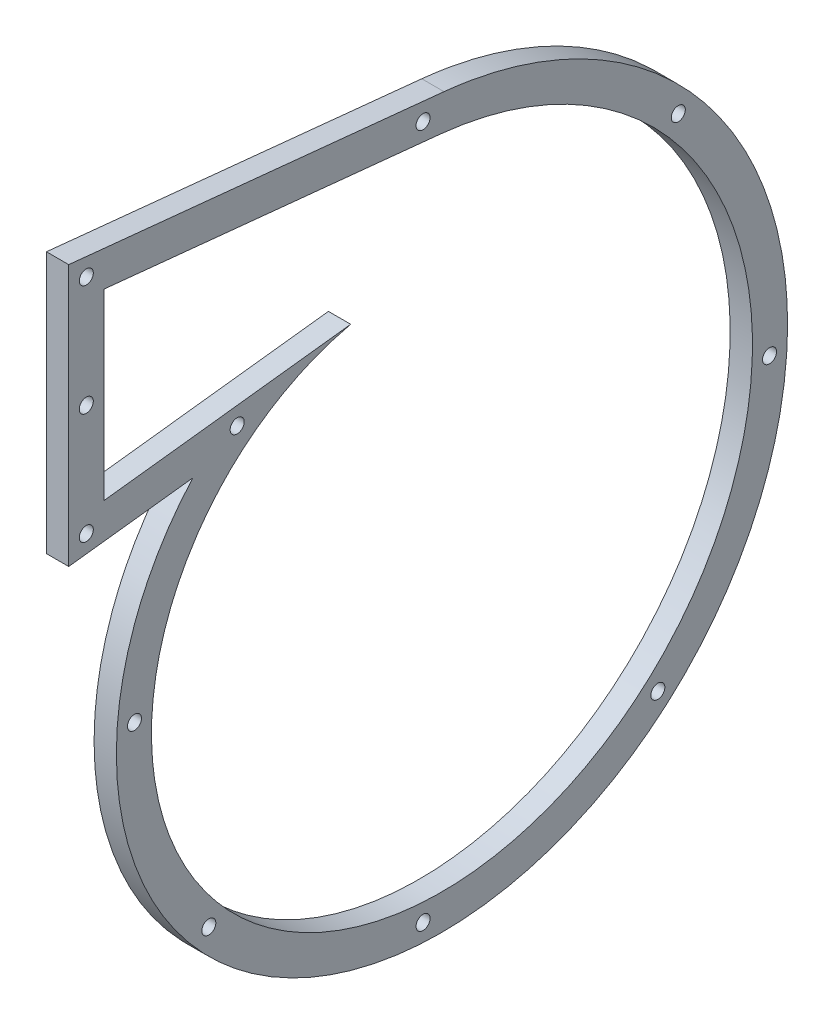
ISO-10303-21;
HEADER;
FILE_DESCRIPTION(('STEP AP214'),'2;1');
FILE_NAME('part.step','',(''),(''),'','','');
FILE_SCHEMA(('AUTOMOTIVE_DESIGN { 1 0 10303 214 1 1 1 1 }'));
ENDSEC;
DATA;
#1=APPLICATION_CONTEXT('core data for automotive mechanical design processes');
#2=APPLICATION_PROTOCOL_DEFINITION('international standard','automotive_design',2000,#1);
#3=PRODUCT_CONTEXT('',#1,'mechanical');
#4=PRODUCT('Part','Part','',(#3));
#5=PRODUCT_RELATED_PRODUCT_CATEGORY('part','',(#4));
#6=PRODUCT_DEFINITION_FORMATION('','',#4);
#7=PRODUCT_DEFINITION_CONTEXT('part definition',#1,'design');
#8=PRODUCT_DEFINITION('design','',#6,#7);
#9=PRODUCT_DEFINITION_SHAPE('','',#8);
#10=(LENGTH_UNIT() NAMED_UNIT(*) SI_UNIT(.MILLI.,.METRE.));
#11=(NAMED_UNIT(*) PLANE_ANGLE_UNIT() SI_UNIT($,.RADIAN.));
#12=(NAMED_UNIT(*) SI_UNIT($,.STERADIAN.) SOLID_ANGLE_UNIT());
#13=UNCERTAINTY_MEASURE_WITH_UNIT(LENGTH_MEASURE(1.E-05),#10,'distance_accuracy_value','');
#14=(GEOMETRIC_REPRESENTATION_CONTEXT(3) GLOBAL_UNCERTAINTY_ASSIGNED_CONTEXT((#13)) GLOBAL_UNIT_ASSIGNED_CONTEXT((#10,
#11,#12)) REPRESENTATION_CONTEXT('',''));
#15=CARTESIAN_POINT('',(0.,0.,0.));
#16=DIRECTION('',(0.,0.,1.));
#17=DIRECTION('',(1.,0.,0.));
#18=AXIS2_PLACEMENT_3D('',#15,#16,#17);
#19=CARTESIAN_POINT('',(6.35,-89.0418354304239,-40.1694675088037));
#20=DIRECTION('',(1.,0.,0.));
#21=DIRECTION('',(0.,0.,-1.));
#22=AXIS2_PLACEMENT_3D('',#19,#20,#21);
#23=PLANE('',#22);
#24=CARTESIAN_POINT('',(6.35,72.7051669902107,-72.7051669902105));
#25=DIRECTION('',(1.,0.,0.));
#26=DIRECTION('',(0.,0.,-1.));
#27=AXIS2_PLACEMENT_3D('',#24,#25,#26);
#28=CIRCLE('',#27,1.99999999999998);
#29=CARTESIAN_POINT('',(6.35,72.7051669902107,-74.7051669902105));
#30=VERTEX_POINT('',#29);
#31=EDGE_CURVE('E228',#30,#30,#28,.T.);
#32=ORIENTED_EDGE('',*,*,#31,.F.);
#33=EDGE_LOOP('',(#32));
#34=FACE_BOUND('',#33,.T.);
#35=CARTESIAN_POINT('',(6.35,-66.8740788460314,-66.8740788460321));
#36=DIRECTION('',(1.,0.,0.));
#37=DIRECTION('',(0.,0.,-1.));
#38=AXIS2_PLACEMENT_3D('',#35,#36,#37);
#39=CIRCLE('',#38,2.00000000000001);
#40=CARTESIAN_POINT('',(6.35,-66.8740788460314,-68.8740788460322));
#41=VERTEX_POINT('',#40);
#42=EDGE_CURVE('E218',#41,#41,#39,.T.);
#43=ORIENTED_EDGE('',*,*,#42,.F.);
#44=EDGE_LOOP('',(#43));
#45=FACE_BOUND('',#44,.T.);
#46=CARTESIAN_POINT('',(6.35,-61.0399944903384,61.0399944903381));
#47=DIRECTION('',(1.,0.,0.));
#48=DIRECTION('',(0.,0.,-1.));
#49=AXIS2_PLACEMENT_3D('',#46,#47,#48);
#50=CIRCLE('',#49,1.99999999999974);
#51=CARTESIAN_POINT('',(6.35,-61.0399944903384,59.0399944903384));
#52=VERTEX_POINT('',#51);
#53=EDGE_CURVE('E215',#52,#52,#50,.T.);
#54=ORIENTED_EDGE('',*,*,#53,.F.);
#55=EDGE_LOOP('',(#54));
#56=FACE_BOUND('',#55,.T.);
#57=CARTESIAN_POINT('',(6.35,107.089716810776,0.));
#58=DIRECTION('',(1.,0.,0.));
#59=DIRECTION('',(0.,0.,-1.));
#60=AXIS2_PLACEMENT_3D('',#57,#58,#59);
#61=CIRCLE('',#60,2.);
#62=CARTESIAN_POINT('',(6.35,107.089716810776,-2.));
#63=VERTEX_POINT('',#62);
#64=EDGE_CURVE('E212',#63,#63,#61,.T.);
#65=ORIENTED_EDGE('',*,*,#64,.F.);
#66=EDGE_LOOP('',(#65));
#67=FACE_BOUND('',#66,.T.);
#68=CARTESIAN_POINT('',(6.35,0.,-98.6958822274498));
#69=DIRECTION('',(1.,0.,0.));
#70=DIRECTION('',(0.,0.,-1.));
#71=AXIS2_PLACEMENT_3D('',#68,#69,#70);
#72=CIRCLE('',#71,2.);
#73=CARTESIAN_POINT('',(6.35,0.,-100.69588222745));
#74=VERTEX_POINT('',#73);
#75=EDGE_CURVE('E208',#74,#74,#72,.T.);
#76=ORIENTED_EDGE('',*,*,#75,.F.);
#77=EDGE_LOOP('',(#76));
#78=FACE_BOUND('',#77,.T.);
#79=CARTESIAN_POINT('',(6.35,-4.99262632104591E-11,82.2024791798422));
#80=DIRECTION('',(1.,0.,0.));
#81=DIRECTION('',(0.,0.,-1.));
#82=AXIS2_PLACEMENT_3D('',#79,#80,#81);
#83=CIRCLE('',#82,2.);
#84=CARTESIAN_POINT('',(6.35,-4.99262632104591E-11,80.2024791798422));
#85=VERTEX_POINT('',#84);
#86=EDGE_CURVE('E204',#85,#85,#83,.T.);
#87=ORIENTED_EDGE('',*,*,#86,.F.);
#88=EDGE_LOOP('',(#87));
#89=FACE_BOUND('',#88,.T.);
#90=CARTESIAN_POINT('',(6.35,-90.4489628653455,0.));
#91=DIRECTION('',(1.,0.,0.));
#92=DIRECTION('',(0.,0.,-1.));
#93=AXIS2_PLACEMENT_3D('',#90,#91,#92);
#94=CIRCLE('',#93,2.);
#95=CARTESIAN_POINT('',(6.35,-90.4489628653455,-2.));
#96=VERTEX_POINT('',#95);
#97=EDGE_CURVE('E200',#96,#96,#94,.T.);
#98=ORIENTED_EDGE('',*,*,#97,.F.);
#99=EDGE_LOOP('',(#98));
#100=FACE_BOUND('',#99,.T.);
#101=CARTESIAN_POINT('',(6.35,58.5427770399441,52.9561202609433));
#102=DIRECTION('',(1.,0.,0.));
#103=DIRECTION('',(0.,0.,-1.));
#104=AXIS2_PLACEMENT_3D('',#101,#102,#103);
#105=CIRCLE('',#104,2.);
#106=CARTESIAN_POINT('',(6.35,58.5427770399441,50.9561202609433));
#107=VERTEX_POINT('',#106);
#108=EDGE_CURVE('E196',#107,#107,#105,.T.);
#109=ORIENTED_EDGE('',*,*,#108,.F.);
#110=EDGE_LOOP('',(#109));
#111=FACE_BOUND('',#110,.T.);
#112=CARTESIAN_POINT('',(6.35,85.0996668726546,95.9356798243954));
#113=DIRECTION('',(1.,0.,0.));
#114=DIRECTION('',(0.,0.,-1.));
#115=AXIS2_PLACEMENT_3D('',#112,#113,#114);
#116=CIRCLE('',#115,2.);
#117=CARTESIAN_POINT('',(6.35,85.0996668726546,93.9356798243954));
#118=VERTEX_POINT('',#117);
#119=EDGE_CURVE('E192',#118,#118,#116,.T.);
#120=ORIENTED_EDGE('',*,*,#119,.F.);
#121=EDGE_LOOP('',(#120));
#122=FACE_BOUND('',#121,.T.);
#123=CARTESIAN_POINT('',(6.35,53.4379914212541,95.9356798243954));
#124=DIRECTION('',(1.,0.,0.));
#125=DIRECTION('',(0.,0.,-1.));
#126=AXIS2_PLACEMENT_3D('',#123,#124,#125);
#127=CIRCLE('',#126,2.);
#128=CARTESIAN_POINT('',(6.35,53.4379914212541,93.9356798243954));
#129=VERTEX_POINT('',#128);
#130=EDGE_CURVE('E188',#129,#129,#127,.T.);
#131=ORIENTED_EDGE('',*,*,#130,.F.);
#132=EDGE_LOOP('',(#131));
#133=FACE_BOUND('',#132,.T.);
#134=CARTESIAN_POINT('',(6.35,116.761342324055,95.9356798243954));
#135=DIRECTION('',(1.,0.,0.));
#136=DIRECTION('',(0.,0.,-1.));
#137=AXIS2_PLACEMENT_3D('',#134,#135,#136);
#138=CIRCLE('',#137,2.);
#139=CARTESIAN_POINT('',(6.35,116.761342324055,93.9356798243954));
#140=VERTEX_POINT('',#139);
#141=EDGE_CURVE('E184',#140,#140,#138,.T.);
#142=ORIENTED_EDGE('',*,*,#141,.F.);
#143=EDGE_LOOP('',(#142));
#144=FACE_BOUND('',#143,.T.);
#145=CARTESIAN_POINT('',(6.35,52.0095312213766,65.5693373401911));
#146=CARTESIAN_POINT('',(6.35,48.5350696343101,68.6986331983437));
#147=CARTESIAN_POINT('',(6.35,41.0756301305954,74.3664321283951));
#148=CARTESIAN_POINT('',(6.35,24.2520637058495,83.1915350243593));
#149=CARTESIAN_POINT('',(6.35,0.571051966812384,88.8162616805835));
#150=CARTESIAN_POINT('',(6.35,-29.0852806445251,85.8046077579747));
#151=CARTESIAN_POINT('',(6.35,-56.6412137555133,72.9797767825643));
#152=CARTESIAN_POINT('',(6.35,-78.8870477416463,51.4145860868804));
#153=CARTESIAN_POINT('',(6.35,-93.091773694092,23.2206106920859));
#154=CARTESIAN_POINT('',(6.35,-97.3413513977909,-8.65488145362865));
#155=CARTESIAN_POINT('',(6.35,-90.784845908172,-40.7390366050227));
#156=CARTESIAN_POINT('',(6.35,-73.7702775520645,-69.4057771791028));
#157=CARTESIAN_POINT('',(6.35,-47.8483099460183,-91.2895524381608));
#158=CARTESIAN_POINT('',(6.35,-15.6364846974259,-103.677945005173));
#159=CARTESIAN_POINT('',(6.35,19.443777188287,-104.843460982403));
#160=CARTESIAN_POINT('',(6.35,53.5337741097882,-94.2744492893508));
#161=CARTESIAN_POINT('',(6.35,77.8773899523179,-76.3494474098506));
#162=CARTESIAN_POINT('',(6.35,93.2003357726446,-57.5832170108413));
#163=CARTESIAN_POINT('',(6.35,102.269141776905,-41.6726008891398));
#164=CARTESIAN_POINT('',(6.35,107.56058488832,-27.2244570687319));
#165=CARTESIAN_POINT('',(6.35,110.322198964791,-15.1957545265602));
#166=CARTESIAN_POINT('',(6.35,111.202679979657,-9.05017451284664));
#167=CARTESIAN_POINT('',(6.35,111.5131692237,-5.97034096630008));
#168=B_SPLINE_CURVE_WITH_KNOTS('',3,(#145,#146,#147,#148,#149,#150,#151,#152,#153,#154,#155,
#156,#157,#158,#159,#160,#161,#162,#163,#164,#165,#166,#167),.UNSPECIFIED.,.F.,.F.,(4,1,1,1,1,1,
1,1,1,1,1,1,1,1,1,1,1,1,1,1,4),(0.103071112424463,0.131100140161198,0.159129167897934,
0.215187223371405,0.271245278844876,0.327303334318347,0.383361389791818,0.439419445265289,
0.49547750073876,0.551535556212231,0.607593611685702,0.663651667159173,0.719709722632645,
0.775767778106116,0.831825833579587,0.887883889053058,0.915912916789793,0.943941944526529,
0.971970972263264,0.985985486131632,1.),.UNSPECIFIED.);
#169=CARTESIAN_POINT('',(6.35,52.0095312213766,65.5693373401911));
#170=VERTEX_POINT('',#169);
#171=CARTESIAN_POINT('',(6.35,111.5131692237,-5.97034096630008));
#172=VERTEX_POINT('',#171);
#173=EDGE_CURVE('E146',#170,#172,#168,.T.);
#174=ORIENTED_EDGE('',*,*,#173,.T.);
#175=DIRECTION('',(0.,0.100305212463325,0.994956714813608));
#176=VECTOR('',#175,1.);
#177=CARTESIAN_POINT('',(6.35,122.290754790352,100.935679824395));
#178=LINE('',#177,#176);
#179=CARTESIAN_POINT('',(6.35,122.290754790352,100.935679824395));
#180=VERTEX_POINT('',#179);
#181=EDGE_CURVE('E152',#172,#180,#178,.T.);
#182=ORIENTED_EDGE('',*,*,#181,.T.);
#183=DIRECTION('',(0.,-1.,0.));
#184=VECTOR('',#183,1.);
#185=CARTESIAN_POINT('',(6.35,47.8089856985101,100.935679824395));
#186=LINE('',#185,#184);
#187=CARTESIAN_POINT('',(6.35,47.8089856985101,100.935679824395));
#188=VERTEX_POINT('',#187);
#189=EDGE_CURVE('E158',#180,#188,#186,.T.);
#190=ORIENTED_EDGE('',*,*,#189,.T.);
#191=DIRECTION('',(0.,0.11794341053639,-0.993020317974937));
#192=VECTOR('',#191,1.);
#193=CARTESIAN_POINT('',(6.35,52.0095312213766,65.5693373401911));
#194=LINE('',#193,#192);
#195=EDGE_CURVE('E160',#188,#170,#194,.T.);
#196=ORIENTED_EDGE('',*,*,#195,.T.);
#197=EDGE_LOOP('',(#174,#182,#190,#196));
#198=FACE_BOUND('',#197,.T.);
#199=DIRECTION('',(0.,0.100305212463325,0.994956714813608));
#200=VECTOR('',#199,1.);
#201=CARTESIAN_POINT('',(6.35,111.231929857758,90.9356798243954));
#202=LINE('',#201,#200);
#203=CARTESIAN_POINT('',(6.35,101.563602075564,-4.96728884166681));
#204=VERTEX_POINT('',#203);
#205=CARTESIAN_POINT('',(6.35,111.231929857758,90.9356798243954));
#206=VERTEX_POINT('',#205);
#207=EDGE_CURVE('E109',#204,#206,#202,.T.);
#208=ORIENTED_EDGE('',*,*,#207,.F.);
#209=CARTESIAN_POINT('',(6.35,67.4194852953939,20.6122051829531));
#210=CARTESIAN_POINT('',(6.35,66.4552678560406,24.8770825732552));
#211=CARTESIAN_POINT('',(6.35,65.0853522172044,29.0812243731984));
#212=CARTESIAN_POINT('',(6.35,61.5604781519011,37.2155939497697));
#213=CARTESIAN_POINT('',(6.35,59.4055438748039,41.1456375361944));
#214=CARTESIAN_POINT('',(6.35,54.3658335171064,48.5847381169988));
#215=CARTESIAN_POINT('',(6.35,51.4811166245284,52.0936166711833));
#216=CARTESIAN_POINT('',(6.35,45.0646597658859,58.5545172391194));
#217=CARTESIAN_POINT('',(6.35,41.5330126833936,61.5063732318608));
#218=CARTESIAN_POINT('',(6.35,33.930844330253,66.7337542582755));
#219=CARTESIAN_POINT('',(6.35,29.8604470267955,69.0091320507026));
#220=CARTESIAN_POINT('',(6.35,21.3109930600804,72.7852012639892));
#221=CARTESIAN_POINT('',(6.35,16.8320876367388,74.2857700342943));
#222=CARTESIAN_POINT('',(6.35,7.61375402946965,76.4390553325685));
#223=CARTESIAN_POINT('',(6.35,2.87449946388243,77.091678836504));
#224=CARTESIAN_POINT('',(6.35,-6.70336711569687,77.5043513011464));
#225=CARTESIAN_POINT('',(6.35,-11.5417889528338,77.26434092386));
#226=CARTESIAN_POINT('',(6.35,-21.1492766229492,75.8777672233438));
#227=CARTESIAN_POINT('',(6.35,-25.9181422710987,74.731181162277));
#228=CARTESIAN_POINT('',(6.35,-35.2161377026869,71.54946298461));
#229=CARTESIAN_POINT('',(6.35,-39.7450643488679,69.514346368891));
#230=CARTESIAN_POINT('',(6.35,-48.3972133974404,64.6056729667148));
#231=CARTESIAN_POINT('',(6.35,-52.5202370221882,61.7321701971579));
#232=CARTESIAN_POINT('',(6.35,-60.205080669813,55.2278863449585));
#233=CARTESIAN_POINT('',(6.35,-63.7667135805631,51.5971966739674));
#234=CARTESIAN_POINT('',(6.35,-70.1895623436975,43.6885696663724));
#235=CARTESIAN_POINT('',(6.35,-73.0506097818801,39.410758629658));
#236=CARTESIAN_POINT('',(6.35,-77.9547201429567,30.343511501828));
#237=CARTESIAN_POINT('',(6.35,-79.9976398461637,25.5542327714463));
#238=CARTESIAN_POINT('',(6.35,-83.1742726405672,15.6209936722327));
#239=CARTESIAN_POINT('',(6.35,-84.3078734197897,10.4772166906422));
#240=CARTESIAN_POINT('',(6.35,-85.6048461535318,0.00811323748628872));
#241=CARTESIAN_POINT('',(6.35,-85.7681414101208,-5.31700990141025));
#242=CARTESIAN_POINT('',(6.35,-85.096533314692,-15.9653103711518));
#243=CARTESIAN_POINT('',(6.35,-84.2615923874771,-21.2882713503272));
#244=CARTESIAN_POINT('',(6.35,-81.6003211965658,-31.7447122070156));
#245=CARTESIAN_POINT('',(6.35,-79.7739946409418,-36.8779702497012));
#246=CARTESIAN_POINT('',(6.35,-75.1720556442354,-46.7700327795938));
#247=CARTESIAN_POINT('',(6.35,-72.3964889028165,-51.5286178316446));
#248=CARTESIAN_POINT('',(6.35,-65.9727273891574,-60.4955749517899));
#249=CARTESIAN_POINT('',(6.35,-62.3246195112766,-64.7037379344225));
#250=CARTESIAN_POINT('',(6.35,-54.2649944811481,-72.4097634454924));
#251=CARTESIAN_POINT('',(6.35,-49.8536031166979,-75.9074349681451));
#252=CARTESIAN_POINT('',(6.35,-40.4059900718697,-82.0540933980427));
#253=CARTESIAN_POINT('',(6.35,-35.3699293227021,-84.7029146048004));
#254=CARTESIAN_POINT('',(6.35,-24.8365998111231,-89.0405698774917));
#255=CARTESIAN_POINT('',(6.35,-19.3395220337717,-90.7292699984907));
#256=CARTESIAN_POINT('',(6.35,-8.06752417025413,-93.0669813290644));
#257=CARTESIAN_POINT('',(6.35,-2.29281885367992,-93.7158957765585));
#258=CARTESIAN_POINT('',(6.35,9.3374369523603,-93.9294155480087));
#259=CARTESIAN_POINT('',(6.35,15.1927561314082,-93.4939654823078));
#260=CARTESIAN_POINT('',(6.35,26.7803315506483,-91.53151500214));
#261=CARTESIAN_POINT('',(6.35,32.5123479134542,-90.0045033486595));
#262=CARTESIAN_POINT('',(6.35,43.6495982980174,-85.8900763529946));
#263=CARTESIAN_POINT('',(6.35,49.0545923045555,-83.3026951638372));
#264=CARTESIAN_POINT('',(6.35,59.3414990502673,-77.136723273371));
#265=CARTESIAN_POINT('',(6.35,64.2231802247645,-73.5582117497144));
#266=CARTESIAN_POINT('',(6.35,73.281690263301,-65.5155179087759));
#267=CARTESIAN_POINT('',(6.35,77.4583044540138,-61.0514578025197));
#268=CARTESIAN_POINT('',(6.35,84.9461637665878,-51.3765198538172));
#269=CARTESIAN_POINT('',(6.35,88.2572190930759,-46.1658036840856));
#270=CARTESIAN_POINT('',(6.35,93.8807959902057,-35.1654472440658));
#271=CARTESIAN_POINT('',(6.35,96.1931598804697,-29.3760030572643));
#272=CARTESIAN_POINT('',(6.35,99.7187809639932,-17.4097372696192));
#273=CARTESIAN_POINT('',(6.35,100.931918806139,-11.2331397891412));
#274=CARTESIAN_POINT('',(6.35,101.563602075564,-4.96728884166681));
#275=B_SPLINE_CURVE_WITH_KNOTS('',3,(#209,#210,#211,#212,#213,#214,#215,#216,#217,#218,#219,
#220,#221,#222,#223,#224,#225,#226,#227,#228,#229,#230,#231,#232,#233,#234,#235,#236,#237,#238,
#239,#240,#241,#242,#243,#244,#245,#246,#247,#248,#249,#250,#251,#252,#253,#254,#255,#256,#257,
#258,#259,#260,#261,#262,#263,#264,#265,#266,#267,#268,#269,#270,#271,#272,#273,#274),
.UNSPECIFIED.,.F.,.F.,(4,2,2,2,2,2,2,2,2,2,2,2,2,2,2,2,2,2,2,2,2,2,2,2,2,2,2,2,2,2,2,2,4),(0.,
0.03125,0.0625,0.09375,0.125,0.15625,0.1875,0.21875,0.25,0.28125,0.3125,0.34375,0.375,0.40625,
0.4375,0.46875,0.5,0.53125,0.5625,0.59375,0.625,0.65625,0.6875,0.71875,0.75,0.78125,0.8125,
0.84375,0.875,0.90625,0.9375,0.96875,1.),.UNSPECIFIED.);
#276=CARTESIAN_POINT('',(6.35,67.4194852953939,20.6122051829531));
#277=VERTEX_POINT('',#276);
#278=EDGE_CURVE('E101',#277,#204,#275,.T.);
#279=ORIENTED_EDGE('',*,*,#278,.F.);
#280=DIRECTION('',(0.,0.11794341053639,-0.993020317974937));
#281=VECTOR('',#280,1.);
#282=CARTESIAN_POINT('',(6.35,67.4194852953939,20.6122051829531));
#283=LINE('',#282,#281);
#284=CARTESIAN_POINT('',(6.35,59.0669971439981,90.9356798243954));
#285=VERTEX_POINT('',#284);
#286=EDGE_CURVE('E123',#285,#277,#283,.T.);
#287=ORIENTED_EDGE('',*,*,#286,.F.);
#288=DIRECTION('',(0.,-1.,0.));
#289=VECTOR('',#288,1.);
#290=CARTESIAN_POINT('',(6.35,59.066997143998,90.9356798243954));
#291=LINE('',#290,#289);
#292=EDGE_CURVE('E121',#206,#285,#291,.T.);
#293=ORIENTED_EDGE('',*,*,#292,.F.);
#294=EDGE_LOOP('',(#208,#279,#287,#293));
#295=FACE_BOUND('',#294,.T.);
#296=ADVANCED_FACE('F33',(#34,#45,#56,#67,#78,#89,#100,#111,#122,#133,#144,#198,#295),#23,.T.);
#297=CARTESIAN_POINT('',(0.,-89.0418354304239,-40.1694675088037));
#298=DIRECTION('',(1.,0.,0.));
#299=DIRECTION('',(0.,0.,-1.));
#300=AXIS2_PLACEMENT_3D('',#297,#298,#299);
#301=PLANE('',#300);
#302=CARTESIAN_POINT('',(0.,72.7051669902107,-72.7051669902105));
#303=DIRECTION('',(1.,0.,0.));
#304=DIRECTION('',(0.,0.,-1.));
#305=AXIS2_PLACEMENT_3D('',#302,#303,#304);
#306=CIRCLE('',#305,1.99999999999998);
#307=CARTESIAN_POINT('',(0.,72.7051669902107,-74.7051669902105));
#308=VERTEX_POINT('',#307);
#309=EDGE_CURVE('E38',#308,#308,#306,.T.);
#310=ORIENTED_EDGE('',*,*,#309,.T.);
#311=EDGE_LOOP('',(#310));
#312=FACE_BOUND('',#311,.T.);
#313=CARTESIAN_POINT('',(0.,-66.8740788460314,-66.8740788460321));
#314=DIRECTION('',(1.,0.,0.));
#315=DIRECTION('',(0.,0.,-1.));
#316=AXIS2_PLACEMENT_3D('',#313,#314,#315);
#317=CIRCLE('',#316,2.00000000000001);
#318=CARTESIAN_POINT('',(0.,-66.8740788460314,-68.8740788460322));
#319=VERTEX_POINT('',#318);
#320=EDGE_CURVE('E216',#319,#319,#317,.T.);
#321=ORIENTED_EDGE('',*,*,#320,.T.);
#322=EDGE_LOOP('',(#321));
#323=FACE_BOUND('',#322,.T.);
#324=CARTESIAN_POINT('',(0.,-61.0399944903384,61.0399944903381));
#325=DIRECTION('',(1.,0.,0.));
#326=DIRECTION('',(0.,0.,-1.));
#327=AXIS2_PLACEMENT_3D('',#324,#325,#326);
#328=CIRCLE('',#327,1.99999999999974);
#329=CARTESIAN_POINT('',(0.,-61.0399944903384,59.0399944903384));
#330=VERTEX_POINT('',#329);
#331=EDGE_CURVE('E213',#330,#330,#328,.T.);
#332=ORIENTED_EDGE('',*,*,#331,.T.);
#333=EDGE_LOOP('',(#332));
#334=FACE_BOUND('',#333,.T.);
#335=CARTESIAN_POINT('',(0.,107.089716810776,0.));
#336=DIRECTION('',(1.,0.,0.));
#337=DIRECTION('',(0.,0.,-1.));
#338=AXIS2_PLACEMENT_3D('',#335,#336,#337);
#339=CIRCLE('',#338,2.);
#340=CARTESIAN_POINT('',(0.,107.089716810776,-2.));
#341=VERTEX_POINT('',#340);
#342=EDGE_CURVE('E209',#341,#341,#339,.T.);
#343=ORIENTED_EDGE('',*,*,#342,.T.);
#344=EDGE_LOOP('',(#343));
#345=FACE_BOUND('',#344,.T.);
#346=CARTESIAN_POINT('',(0.,0.,-98.6958822274498));
#347=DIRECTION('',(1.,0.,0.));
#348=DIRECTION('',(0.,0.,-1.));
#349=AXIS2_PLACEMENT_3D('',#346,#347,#348);
#350=CIRCLE('',#349,2.);
#351=CARTESIAN_POINT('',(0.,0.,-100.69588222745));
#352=VERTEX_POINT('',#351);
#353=EDGE_CURVE('E205',#352,#352,#350,.T.);
#354=ORIENTED_EDGE('',*,*,#353,.T.);
#355=EDGE_LOOP('',(#354));
#356=FACE_BOUND('',#355,.T.);
#357=CARTESIAN_POINT('',(0.,-4.99262632104591E-11,82.2024791798422));
#358=DIRECTION('',(1.,0.,0.));
#359=DIRECTION('',(0.,0.,-1.));
#360=AXIS2_PLACEMENT_3D('',#357,#358,#359);
#361=CIRCLE('',#360,2.);
#362=CARTESIAN_POINT('',(0.,-4.99262632104591E-11,80.2024791798422));
#363=VERTEX_POINT('',#362);
#364=EDGE_CURVE('E201',#363,#363,#361,.T.);
#365=ORIENTED_EDGE('',*,*,#364,.T.);
#366=EDGE_LOOP('',(#365));
#367=FACE_BOUND('',#366,.T.);
#368=CARTESIAN_POINT('',(0.,-90.4489628653455,0.));
#369=DIRECTION('',(1.,0.,0.));
#370=DIRECTION('',(0.,0.,-1.));
#371=AXIS2_PLACEMENT_3D('',#368,#369,#370);
#372=CIRCLE('',#371,2.);
#373=CARTESIAN_POINT('',(0.,-90.4489628653455,-2.));
#374=VERTEX_POINT('',#373);
#375=EDGE_CURVE('E197',#374,#374,#372,.T.);
#376=ORIENTED_EDGE('',*,*,#375,.T.);
#377=EDGE_LOOP('',(#376));
#378=FACE_BOUND('',#377,.T.);
#379=CARTESIAN_POINT('',(0.,58.5427770399441,52.9561202609433));
#380=DIRECTION('',(1.,0.,0.));
#381=DIRECTION('',(0.,0.,-1.));
#382=AXIS2_PLACEMENT_3D('',#379,#380,#381);
#383=CIRCLE('',#382,2.);
#384=CARTESIAN_POINT('',(0.,58.5427770399441,50.9561202609433));
#385=VERTEX_POINT('',#384);
#386=EDGE_CURVE('E193',#385,#385,#383,.T.);
#387=ORIENTED_EDGE('',*,*,#386,.T.);
#388=EDGE_LOOP('',(#387));
#389=FACE_BOUND('',#388,.T.);
#390=CARTESIAN_POINT('',(0.,85.0996668726546,95.9356798243954));
#391=DIRECTION('',(1.,0.,0.));
#392=DIRECTION('',(0.,0.,-1.));
#393=AXIS2_PLACEMENT_3D('',#390,#391,#392);
#394=CIRCLE('',#393,2.);
#395=CARTESIAN_POINT('',(0.,85.0996668726546,93.9356798243954));
#396=VERTEX_POINT('',#395);
#397=EDGE_CURVE('E189',#396,#396,#394,.T.);
#398=ORIENTED_EDGE('',*,*,#397,.T.);
#399=EDGE_LOOP('',(#398));
#400=FACE_BOUND('',#399,.T.);
#401=CARTESIAN_POINT('',(0.,53.4379914212541,95.9356798243954));
#402=DIRECTION('',(1.,0.,0.));
#403=DIRECTION('',(0.,0.,-1.));
#404=AXIS2_PLACEMENT_3D('',#401,#402,#403);
#405=CIRCLE('',#404,2.);
#406=CARTESIAN_POINT('',(0.,53.4379914212541,93.9356798243954));
#407=VERTEX_POINT('',#406);
#408=EDGE_CURVE('E185',#407,#407,#405,.T.);
#409=ORIENTED_EDGE('',*,*,#408,.T.);
#410=EDGE_LOOP('',(#409));
#411=FACE_BOUND('',#410,.T.);
#412=CARTESIAN_POINT('',(0.,116.761342324055,95.9356798243954));
#413=DIRECTION('',(1.,0.,0.));
#414=DIRECTION('',(0.,0.,-1.));
#415=AXIS2_PLACEMENT_3D('',#412,#413,#414);
#416=CIRCLE('',#415,2.);
#417=CARTESIAN_POINT('',(0.,116.761342324055,93.9356798243954));
#418=VERTEX_POINT('',#417);
#419=EDGE_CURVE('E134',#418,#418,#416,.T.);
#420=ORIENTED_EDGE('',*,*,#419,.T.);
#421=EDGE_LOOP('',(#420));
#422=FACE_BOUND('',#421,.T.);
#423=CARTESIAN_POINT('',(0.,52.0095312213766,65.5693373401911));
#424=CARTESIAN_POINT('',(0.,48.5350696343101,68.6986331983437));
#425=CARTESIAN_POINT('',(0.,41.0756301305954,74.3664321283951));
#426=CARTESIAN_POINT('',(0.,24.2520637058495,83.1915350243593));
#427=CARTESIAN_POINT('',(0.,0.571051966812384,88.8162616805835));
#428=CARTESIAN_POINT('',(0.,-29.0852806445251,85.8046077579747));
#429=CARTESIAN_POINT('',(0.,-56.6412137555133,72.9797767825643));
#430=CARTESIAN_POINT('',(0.,-78.8870477416463,51.4145860868804));
#431=CARTESIAN_POINT('',(0.,-93.091773694092,23.2206106920859));
#432=CARTESIAN_POINT('',(0.,-97.3413513977909,-8.65488145362865));
#433=CARTESIAN_POINT('',(0.,-90.784845908172,-40.7390366050227));
#434=CARTESIAN_POINT('',(0.,-73.7702775520645,-69.4057771791028));
#435=CARTESIAN_POINT('',(0.,-47.8483099460183,-91.2895524381608));
#436=CARTESIAN_POINT('',(0.,-15.6364846974259,-103.677945005173));
#437=CARTESIAN_POINT('',(0.,19.443777188287,-104.843460982403));
#438=CARTESIAN_POINT('',(0.,53.5337741097882,-94.2744492893508));
#439=CARTESIAN_POINT('',(0.,77.8773899523179,-76.3494474098506));
#440=CARTESIAN_POINT('',(0.,93.2003357726446,-57.5832170108413));
#441=CARTESIAN_POINT('',(0.,102.269141776905,-41.6726008891398));
#442=CARTESIAN_POINT('',(0.,107.56058488832,-27.2244570687319));
#443=CARTESIAN_POINT('',(0.,110.322198964791,-15.1957545265602));
#444=CARTESIAN_POINT('',(0.,111.202679979657,-9.05017451284664));
#445=CARTESIAN_POINT('',(0.,111.5131692237,-5.97034096630008));
#446=B_SPLINE_CURVE_WITH_KNOTS('',3,(#423,#424,#425,#426,#427,#428,#429,#430,#431,#432,#433,
#434,#435,#436,#437,#438,#439,#440,#441,#442,#443,#444,#445),.UNSPECIFIED.,.F.,.F.,(4,1,1,1,1,1,
1,1,1,1,1,1,1,1,1,1,1,1,1,1,4),(0.103071112424463,0.131100140161198,0.159129167897934,
0.215187223371405,0.271245278844876,0.327303334318347,0.383361389791818,0.439419445265289,
0.49547750073876,0.551535556212231,0.607593611685702,0.663651667159173,0.719709722632645,
0.775767778106116,0.831825833579587,0.887883889053058,0.915912916789793,0.943941944526529,
0.971970972263264,0.985985486131632,1.),.UNSPECIFIED.);
#447=CARTESIAN_POINT('',(0.,52.0095312213766,65.5693373401911));
#448=VERTEX_POINT('',#447);
#449=CARTESIAN_POINT('',(0.,111.5131692237,-5.97034096630008));
#450=VERTEX_POINT('',#449);
#451=EDGE_CURVE('E117',#448,#450,#446,.T.);
#452=ORIENTED_EDGE('',*,*,#451,.F.);
#453=DIRECTION('',(0.,0.11794341053639,-0.993020317974937));
#454=VECTOR('',#453,1.);
#455=CARTESIAN_POINT('',(0.,52.0095312213766,65.5693373401911));
#456=LINE('',#455,#454);
#457=CARTESIAN_POINT('',(0.,47.8089856985101,100.935679824395));
#458=VERTEX_POINT('',#457);
#459=EDGE_CURVE('E153',#458,#448,#456,.T.);
#460=ORIENTED_EDGE('',*,*,#459,.F.);
#461=DIRECTION('',(0.,-1.,0.));
#462=VECTOR('',#461,1.);
#463=CARTESIAN_POINT('',(0.,47.8089856985101,100.935679824395));
#464=LINE('',#463,#462);
#465=CARTESIAN_POINT('',(0.,122.290754790352,100.935679824395));
#466=VERTEX_POINT('',#465);
#467=EDGE_CURVE('E172',#466,#458,#464,.T.);
#468=ORIENTED_EDGE('',*,*,#467,.F.);
#469=DIRECTION('',(0.,0.100305212463325,0.994956714813608));
#470=VECTOR('',#469,1.);
#471=CARTESIAN_POINT('',(0.,122.290754790352,100.935679824395));
#472=LINE('',#471,#470);
#473=EDGE_CURVE('E167',#450,#466,#472,.T.);
#474=ORIENTED_EDGE('',*,*,#473,.F.);
#475=EDGE_LOOP('',(#452,#460,#468,#474));
#476=FACE_BOUND('',#475,.T.);
#477=CARTESIAN_POINT('',(0.,67.4194852953939,20.6122051829531));
#478=CARTESIAN_POINT('',(0.,66.4552678560406,24.8770825732552));
#479=CARTESIAN_POINT('',(0.,65.0853522172044,29.0812243731984));
#480=CARTESIAN_POINT('',(0.,61.5604781519011,37.2155939497697));
#481=CARTESIAN_POINT('',(0.,59.4055438748039,41.1456375361944));
#482=CARTESIAN_POINT('',(0.,54.3658335171064,48.5847381169988));
#483=CARTESIAN_POINT('',(0.,51.4811166245284,52.0936166711833));
#484=CARTESIAN_POINT('',(0.,45.0646597658859,58.5545172391194));
#485=CARTESIAN_POINT('',(0.,41.5330126833936,61.5063732318608));
#486=CARTESIAN_POINT('',(0.,33.930844330253,66.7337542582755));
#487=CARTESIAN_POINT('',(0.,29.8604470267955,69.0091320507026));
#488=CARTESIAN_POINT('',(0.,21.3109930600804,72.7852012639892));
#489=CARTESIAN_POINT('',(0.,16.8320876367388,74.2857700342943));
#490=CARTESIAN_POINT('',(0.,7.61375402946965,76.4390553325685));
#491=CARTESIAN_POINT('',(0.,2.87449946388243,77.091678836504));
#492=CARTESIAN_POINT('',(0.,-6.70336711569687,77.5043513011464));
#493=CARTESIAN_POINT('',(0.,-11.5417889528338,77.26434092386));
#494=CARTESIAN_POINT('',(0.,-21.1492766229492,75.8777672233438));
#495=CARTESIAN_POINT('',(0.,-25.9181422710987,74.731181162277));
#496=CARTESIAN_POINT('',(0.,-35.2161377026869,71.54946298461));
#497=CARTESIAN_POINT('',(0.,-39.7450643488679,69.514346368891));
#498=CARTESIAN_POINT('',(0.,-48.3972133974404,64.6056729667148));
#499=CARTESIAN_POINT('',(0.,-52.5202370221882,61.7321701971579));
#500=CARTESIAN_POINT('',(0.,-60.205080669813,55.2278863449585));
#501=CARTESIAN_POINT('',(0.,-63.7667135805631,51.5971966739674));
#502=CARTESIAN_POINT('',(0.,-70.1895623436975,43.6885696663724));
#503=CARTESIAN_POINT('',(0.,-73.0506097818801,39.410758629658));
#504=CARTESIAN_POINT('',(0.,-77.9547201429567,30.343511501828));
#505=CARTESIAN_POINT('',(0.,-79.9976398461637,25.5542327714463));
#506=CARTESIAN_POINT('',(0.,-83.1742726405672,15.6209936722327));
#507=CARTESIAN_POINT('',(0.,-84.3078734197897,10.4772166906422));
#508=CARTESIAN_POINT('',(0.,-85.6048461535318,0.00811323748628872));
#509=CARTESIAN_POINT('',(0.,-85.7681414101208,-5.31700990141025));
#510=CARTESIAN_POINT('',(0.,-85.096533314692,-15.9653103711518));
#511=CARTESIAN_POINT('',(0.,-84.2615923874771,-21.2882713503272));
#512=CARTESIAN_POINT('',(0.,-81.6003211965658,-31.7447122070156));
#513=CARTESIAN_POINT('',(0.,-79.7739946409418,-36.8779702497012));
#514=CARTESIAN_POINT('',(0.,-75.1720556442354,-46.7700327795938));
#515=CARTESIAN_POINT('',(0.,-72.3964889028165,-51.5286178316446));
#516=CARTESIAN_POINT('',(0.,-65.9727273891574,-60.4955749517899));
#517=CARTESIAN_POINT('',(0.,-62.3246195112766,-64.7037379344225));
#518=CARTESIAN_POINT('',(0.,-54.2649944811481,-72.4097634454924));
#519=CARTESIAN_POINT('',(0.,-49.8536031166979,-75.9074349681451));
#520=CARTESIAN_POINT('',(0.,-40.4059900718697,-82.0540933980427));
#521=CARTESIAN_POINT('',(0.,-35.3699293227021,-84.7029146048004));
#522=CARTESIAN_POINT('',(0.,-24.8365998111231,-89.0405698774917));
#523=CARTESIAN_POINT('',(0.,-19.3395220337717,-90.7292699984907));
#524=CARTESIAN_POINT('',(0.,-8.06752417025413,-93.0669813290644));
#525=CARTESIAN_POINT('',(0.,-2.29281885367992,-93.7158957765585));
#526=CARTESIAN_POINT('',(0.,9.3374369523603,-93.9294155480087));
#527=CARTESIAN_POINT('',(0.,15.1927561314082,-93.4939654823078));
#528=CARTESIAN_POINT('',(0.,26.7803315506483,-91.53151500214));
#529=CARTESIAN_POINT('',(0.,32.5123479134542,-90.0045033486595));
#530=CARTESIAN_POINT('',(0.,43.6495982980174,-85.8900763529946));
#531=CARTESIAN_POINT('',(0.,49.0545923045555,-83.3026951638372));
#532=CARTESIAN_POINT('',(0.,59.3414990502673,-77.136723273371));
#533=CARTESIAN_POINT('',(0.,64.2231802247645,-73.5582117497144));
#534=CARTESIAN_POINT('',(0.,73.281690263301,-65.5155179087759));
#535=CARTESIAN_POINT('',(0.,77.4583044540138,-61.0514578025197));
#536=CARTESIAN_POINT('',(0.,84.9461637665878,-51.3765198538172));
#537=CARTESIAN_POINT('',(0.,88.2572190930759,-46.1658036840856));
#538=CARTESIAN_POINT('',(0.,93.8807959902057,-35.1654472440658));
#539=CARTESIAN_POINT('',(0.,96.1931598804697,-29.3760030572643));
#540=CARTESIAN_POINT('',(0.,99.7187809639932,-17.4097372696192));
#541=CARTESIAN_POINT('',(0.,100.931918806139,-11.2331397891412));
#542=CARTESIAN_POINT('',(0.,101.563602075564,-4.96728884166681));
#543=B_SPLINE_CURVE_WITH_KNOTS('',3,(#477,#478,#479,#480,#481,#482,#483,#484,#485,#486,#487,
#488,#489,#490,#491,#492,#493,#494,#495,#496,#497,#498,#499,#500,#501,#502,#503,#504,#505,#506,
#507,#508,#509,#510,#511,#512,#513,#514,#515,#516,#517,#518,#519,#520,#521,#522,#523,#524,#525,
#526,#527,#528,#529,#530,#531,#532,#533,#534,#535,#536,#537,#538,#539,#540,#541,#542),
.UNSPECIFIED.,.F.,.F.,(4,2,2,2,2,2,2,2,2,2,2,2,2,2,2,2,2,2,2,2,2,2,2,2,2,2,2,2,2,2,2,2,4),(0.,
0.03125,0.0625,0.09375,0.125,0.15625,0.1875,0.21875,0.25,0.28125,0.3125,0.34375,0.375,0.40625,
0.4375,0.46875,0.5,0.53125,0.5625,0.59375,0.625,0.65625,0.6875,0.71875,0.75,0.78125,0.8125,
0.84375,0.875,0.90625,0.9375,0.96875,1.),.UNSPECIFIED.);
#544=CARTESIAN_POINT('',(0.,67.419485295394,20.6122051829531));
#545=VERTEX_POINT('',#544);
#546=CARTESIAN_POINT('',(0.,101.563602075564,-4.96728884166681));
#547=VERTEX_POINT('',#546);
#548=EDGE_CURVE('E59',#545,#547,#543,.T.);
#549=ORIENTED_EDGE('',*,*,#548,.T.);
#550=DIRECTION('',(0.,0.100305212463325,0.994956714813608));
#551=VECTOR('',#550,1.);
#552=CARTESIAN_POINT('',(0.,111.231929857758,90.9356798243954));
#553=LINE('',#552,#551);
#554=CARTESIAN_POINT('',(0.,111.231929857758,90.9356798243954));
#555=VERTEX_POINT('',#554);
#556=EDGE_CURVE('E116',#547,#555,#553,.T.);
#557=ORIENTED_EDGE('',*,*,#556,.T.);
#558=DIRECTION('',(0.,-1.,0.));
#559=VECTOR('',#558,1.);
#560=CARTESIAN_POINT('',(0.,59.066997143998,90.9356798243954));
#561=LINE('',#560,#559);
#562=CARTESIAN_POINT('',(0.,59.066997143998,90.9356798243954));
#563=VERTEX_POINT('',#562);
#564=EDGE_CURVE('E139',#555,#563,#561,.T.);
#565=ORIENTED_EDGE('',*,*,#564,.T.);
#566=DIRECTION('',(0.,0.11794341053639,-0.993020317974937));
#567=VECTOR('',#566,1.);
#568=CARTESIAN_POINT('',(0.,67.4194852953939,20.6122051829531));
#569=LINE('',#568,#567);
#570=EDGE_CURVE('E110',#563,#545,#569,.T.);
#571=ORIENTED_EDGE('',*,*,#570,.T.);
#572=EDGE_LOOP('',(#549,#557,#565,#571));
#573=FACE_BOUND('',#572,.T.);
#574=ADVANCED_FACE('F252',(#312,#323,#334,#345,#356,#367,#378,#389,#400,#411,#422,#476,#573),
#301,.F.);
#575=DIRECTION('',(-1.,0.,0.));
#576=VECTOR('',#575,1.);
#577=SURFACE_OF_LINEAR_EXTRUSION('',#168,#576);
#578=ORIENTED_EDGE('',*,*,#451,.T.);
#579=DIRECTION('',(-1.,0.,0.));
#580=VECTOR('',#579,1.);
#581=CARTESIAN_POINT('',(6.35,111.5131692237,-5.97034096630008));
#582=LINE('',#581,#580);
#583=EDGE_CURVE('E11',#172,#450,#582,.T.);
#584=ORIENTED_EDGE('',*,*,#583,.F.);
#585=ORIENTED_EDGE('',*,*,#173,.F.);
#586=DIRECTION('',(-1.,0.,0.));
#587=VECTOR('',#586,1.);
#588=CARTESIAN_POINT('',(6.35,52.0095312213766,65.5693373401911));
#589=LINE('',#588,#587);
#590=EDGE_CURVE('E162',#170,#448,#589,.T.);
#591=ORIENTED_EDGE('',*,*,#590,.T.);
#592=EDGE_LOOP('',(#578,#584,#585,#591));
#593=FACE_BOUND('',#592,.T.);
#594=ADVANCED_FACE('F35',(#593),#577,.F.);
#595=CARTESIAN_POINT('',(6.35,122.290754790352,100.935679824395));
#596=DIRECTION('',(0.,-0.994956714813608,0.100305212463325));
#597=DIRECTION('',(0.,-0.100305212463325,-0.994956714813608));
#598=AXIS2_PLACEMENT_3D('',#595,#596,#597);
#599=PLANE('',#598);
#600=ORIENTED_EDGE('',*,*,#473,.T.);
#601=DIRECTION('',(-1.,0.,0.));
#602=VECTOR('',#601,1.);
#603=CARTESIAN_POINT('',(6.35,122.290754790352,100.935679824395));
#604=LINE('',#603,#602);
#605=EDGE_CURVE('E43',#180,#466,#604,.T.);
#606=ORIENTED_EDGE('',*,*,#605,.F.);
#607=ORIENTED_EDGE('',*,*,#181,.F.);
#608=ORIENTED_EDGE('',*,*,#583,.T.);
#609=EDGE_LOOP('',(#600,#606,#607,#608));
#610=FACE_BOUND('',#609,.T.);
#611=ADVANCED_FACE('F263',(#610),#599,.F.);
#612=CARTESIAN_POINT('',(6.35,47.8089856985101,100.935679824395));
#613=DIRECTION('',(0.,0.,-1.));
#614=DIRECTION('',(-1.,0.,0.));
#615=AXIS2_PLACEMENT_3D('',#612,#613,#614);
#616=PLANE('',#615);
#617=ORIENTED_EDGE('',*,*,#467,.T.);
#618=DIRECTION('',(-1.,0.,0.));
#619=VECTOR('',#618,1.);
#620=CARTESIAN_POINT('',(6.35,47.8089856985101,100.935679824395));
#621=LINE('',#620,#619);
#622=EDGE_CURVE('E177',#188,#458,#621,.T.);
#623=ORIENTED_EDGE('',*,*,#622,.F.);
#624=ORIENTED_EDGE('',*,*,#189,.F.);
#625=ORIENTED_EDGE('',*,*,#605,.T.);
#626=EDGE_LOOP('',(#617,#623,#624,#625));
#627=FACE_BOUND('',#626,.T.);
#628=ADVANCED_FACE('F268',(#627),#616,.F.);
#629=CARTESIAN_POINT('',(6.35,52.0095312213766,65.5693373401911));
#630=DIRECTION('',(0.,0.993020317974937,0.11794341053639));
#631=DIRECTION('',(0.,-0.11794341053639,0.993020317974937));
#632=AXIS2_PLACEMENT_3D('',#629,#630,#631);
#633=PLANE('',#632);
#634=ORIENTED_EDGE('',*,*,#459,.T.);
#635=ORIENTED_EDGE('',*,*,#590,.F.);
#636=ORIENTED_EDGE('',*,*,#195,.F.);
#637=ORIENTED_EDGE('',*,*,#622,.T.);
#638=EDGE_LOOP('',(#634,#635,#636,#637));
#639=FACE_BOUND('',#638,.T.);
#640=ADVANCED_FACE('F271',(#639),#633,.F.);
#641=DIRECTION('',(-1.,0.,0.));
#642=VECTOR('',#641,1.);
#643=SURFACE_OF_LINEAR_EXTRUSION('',#275,#642);
#644=ORIENTED_EDGE('',*,*,#548,.F.);
#645=DIRECTION('',(-1.,0.,0.));
#646=VECTOR('',#645,1.);
#647=CARTESIAN_POINT('',(6.35,67.4194852953939,20.6122051829531));
#648=LINE('',#647,#646);
#649=EDGE_CURVE('E105',#277,#545,#648,.T.);
#650=ORIENTED_EDGE('',*,*,#649,.F.);
#651=ORIENTED_EDGE('',*,*,#278,.T.);
#652=DIRECTION('',(-1.,0.,0.));
#653=VECTOR('',#652,1.);
#654=CARTESIAN_POINT('',(6.35,101.563602075564,-4.96728884166681));
#655=LINE('',#654,#653);
#656=EDGE_CURVE('E104',#204,#547,#655,.T.);
#657=ORIENTED_EDGE('',*,*,#656,.T.);
#658=EDGE_LOOP('',(#644,#650,#651,#657));
#659=FACE_BOUND('',#658,.T.);
#660=ADVANCED_FACE('F103',(#659),#643,.T.);
#661=CARTESIAN_POINT('',(6.35,111.231929857758,90.9356798243954));
#662=DIRECTION('',(0.,-0.994956714813608,0.100305212463325));
#663=DIRECTION('',(0.,-0.100305212463325,-0.994956714813608));
#664=AXIS2_PLACEMENT_3D('',#661,#662,#663);
#665=PLANE('',#664);
#666=ORIENTED_EDGE('',*,*,#556,.F.);
#667=ORIENTED_EDGE('',*,*,#656,.F.);
#668=ORIENTED_EDGE('',*,*,#207,.T.);
#669=DIRECTION('',(-1.,0.,0.));
#670=VECTOR('',#669,1.);
#671=CARTESIAN_POINT('',(6.35,111.231929857758,90.9356798243954));
#672=LINE('',#671,#670);
#673=EDGE_CURVE('E118',#206,#555,#672,.T.);
#674=ORIENTED_EDGE('',*,*,#673,.T.);
#675=EDGE_LOOP('',(#666,#667,#668,#674));
#676=FACE_BOUND('',#675,.T.);
#677=ADVANCED_FACE('F113',(#676),#665,.T.);
#678=CARTESIAN_POINT('',(6.35,59.066997143998,90.9356798243954));
#679=DIRECTION('',(0.,0.,-1.));
#680=DIRECTION('',(-1.,0.,0.));
#681=AXIS2_PLACEMENT_3D('',#678,#679,#680);
#682=PLANE('',#681);
#683=ORIENTED_EDGE('',*,*,#564,.F.);
#684=ORIENTED_EDGE('',*,*,#673,.F.);
#685=ORIENTED_EDGE('',*,*,#292,.T.);
#686=DIRECTION('',(-1.,0.,0.));
#687=VECTOR('',#686,1.);
#688=CARTESIAN_POINT('',(6.35,59.066997143998,90.9356798243954));
#689=LINE('',#688,#687);
#690=EDGE_CURVE('E51',#285,#563,#689,.T.);
#691=ORIENTED_EDGE('',*,*,#690,.T.);
#692=EDGE_LOOP('',(#683,#684,#685,#691));
#693=FACE_BOUND('',#692,.T.);
#694=ADVANCED_FACE('F280',(#693),#682,.T.);
#695=CARTESIAN_POINT('',(6.35,67.4194852953939,20.6122051829531));
#696=DIRECTION('',(0.,0.993020317974937,0.11794341053639));
#697=DIRECTION('',(0.,-0.11794341053639,0.993020317974937));
#698=AXIS2_PLACEMENT_3D('',#695,#696,#697);
#699=PLANE('',#698);
#700=ORIENTED_EDGE('',*,*,#570,.F.);
#701=ORIENTED_EDGE('',*,*,#690,.F.);
#702=ORIENTED_EDGE('',*,*,#286,.T.);
#703=ORIENTED_EDGE('',*,*,#649,.T.);
#704=EDGE_LOOP('',(#700,#701,#702,#703));
#705=FACE_BOUND('',#704,.T.);
#706=ADVANCED_FACE('F278',(#705),#699,.T.);
#707=CARTESIAN_POINT('',(-3.65,116.761342324055,95.9356798243954));
#708=DIRECTION('',(1.,0.,0.));
#709=DIRECTION('',(0.,0.,-1.));
#710=AXIS2_PLACEMENT_3D('',#707,#708,#709);
#711=CYLINDRICAL_SURFACE('',#710,2.);
#712=ORIENTED_EDGE('',*,*,#141,.T.);
#713=EDGE_LOOP('',(#712));
#714=FACE_BOUND('',#713,.T.);
#715=ORIENTED_EDGE('',*,*,#419,.F.);
#716=EDGE_LOOP('',(#715));
#717=FACE_BOUND('',#716,.T.);
#718=ADVANCED_FACE('F247',(#714,#717),#711,.F.);
#719=CARTESIAN_POINT('',(-3.65,53.4379914212541,95.9356798243954));
#720=DIRECTION('',(1.,0.,0.));
#721=DIRECTION('',(0.,0.,-1.));
#722=AXIS2_PLACEMENT_3D('',#719,#720,#721);
#723=CYLINDRICAL_SURFACE('',#722,2.);
#724=ORIENTED_EDGE('',*,*,#130,.T.);
#725=EDGE_LOOP('',(#724));
#726=FACE_BOUND('',#725,.T.);
#727=ORIENTED_EDGE('',*,*,#408,.F.);
#728=EDGE_LOOP('',(#727));
#729=FACE_BOUND('',#728,.T.);
#730=ADVANCED_FACE('F286',(#726,#729),#723,.F.);
#731=CARTESIAN_POINT('',(-3.65,85.0996668726546,95.9356798243954));
#732=DIRECTION('',(1.,0.,0.));
#733=DIRECTION('',(0.,0.,-1.));
#734=AXIS2_PLACEMENT_3D('',#731,#732,#733);
#735=CYLINDRICAL_SURFACE('',#734,2.);
#736=ORIENTED_EDGE('',*,*,#119,.T.);
#737=EDGE_LOOP('',(#736));
#738=FACE_BOUND('',#737,.T.);
#739=ORIENTED_EDGE('',*,*,#397,.F.);
#740=EDGE_LOOP('',(#739));
#741=FACE_BOUND('',#740,.T.);
#742=ADVANCED_FACE('F370',(#738,#741),#735,.F.);
#743=CARTESIAN_POINT('',(-3.65,58.5427770399441,52.9561202609433));
#744=DIRECTION('',(1.,0.,0.));
#745=DIRECTION('',(0.,0.,-1.));
#746=AXIS2_PLACEMENT_3D('',#743,#744,#745);
#747=CYLINDRICAL_SURFACE('',#746,2.);
#748=ORIENTED_EDGE('',*,*,#108,.T.);
#749=EDGE_LOOP('',(#748));
#750=FACE_BOUND('',#749,.T.);
#751=ORIENTED_EDGE('',*,*,#386,.F.);
#752=EDGE_LOOP('',(#751));
#753=FACE_BOUND('',#752,.T.);
#754=ADVANCED_FACE('F378',(#750,#753),#747,.F.);
#755=CARTESIAN_POINT('',(-3.65,-90.4489628653455,0.));
#756=DIRECTION('',(1.,0.,0.));
#757=DIRECTION('',(0.,0.,-1.));
#758=AXIS2_PLACEMENT_3D('',#755,#756,#757);
#759=CYLINDRICAL_SURFACE('',#758,2.);
#760=ORIENTED_EDGE('',*,*,#97,.T.);
#761=EDGE_LOOP('',(#760));
#762=FACE_BOUND('',#761,.T.);
#763=ORIENTED_EDGE('',*,*,#375,.F.);
#764=EDGE_LOOP('',(#763));
#765=FACE_BOUND('',#764,.T.);
#766=ADVANCED_FACE('F387',(#762,#765),#759,.F.);
#767=CARTESIAN_POINT('',(-3.65,-4.99262632104591E-11,82.2024791798422));
#768=DIRECTION('',(1.,0.,0.));
#769=DIRECTION('',(0.,0.,-1.));
#770=AXIS2_PLACEMENT_3D('',#767,#768,#769);
#771=CYLINDRICAL_SURFACE('',#770,2.);
#772=ORIENTED_EDGE('',*,*,#86,.T.);
#773=EDGE_LOOP('',(#772));
#774=FACE_BOUND('',#773,.T.);
#775=ORIENTED_EDGE('',*,*,#364,.F.);
#776=EDGE_LOOP('',(#775));
#777=FACE_BOUND('',#776,.T.);
#778=ADVANCED_FACE('F396',(#774,#777),#771,.F.);
#779=CARTESIAN_POINT('',(-3.65,0.,-98.6958822274498));
#780=DIRECTION('',(1.,0.,0.));
#781=DIRECTION('',(0.,0.,-1.));
#782=AXIS2_PLACEMENT_3D('',#779,#780,#781);
#783=CYLINDRICAL_SURFACE('',#782,2.);
#784=ORIENTED_EDGE('',*,*,#75,.T.);
#785=EDGE_LOOP('',(#784));
#786=FACE_BOUND('',#785,.T.);
#787=ORIENTED_EDGE('',*,*,#353,.F.);
#788=EDGE_LOOP('',(#787));
#789=FACE_BOUND('',#788,.T.);
#790=ADVANCED_FACE('F405',(#786,#789),#783,.F.);
#791=CARTESIAN_POINT('',(-3.65,107.089716810776,0.));
#792=DIRECTION('',(1.,0.,0.));
#793=DIRECTION('',(0.,0.,-1.));
#794=AXIS2_PLACEMENT_3D('',#791,#792,#793);
#795=CYLINDRICAL_SURFACE('',#794,2.);
#796=ORIENTED_EDGE('',*,*,#64,.T.);
#797=EDGE_LOOP('',(#796));
#798=FACE_BOUND('',#797,.T.);
#799=ORIENTED_EDGE('',*,*,#342,.F.);
#800=EDGE_LOOP('',(#799));
#801=FACE_BOUND('',#800,.T.);
#802=ADVANCED_FACE('F414',(#798,#801),#795,.F.);
#803=CARTESIAN_POINT('',(-3.65,-61.0399944903384,61.0399944903381));
#804=DIRECTION('',(1.,0.,0.));
#805=DIRECTION('',(0.,0.,-1.));
#806=AXIS2_PLACEMENT_3D('',#803,#804,#805);
#807=CYLINDRICAL_SURFACE('',#806,1.99999999999974);
#808=ORIENTED_EDGE('',*,*,#53,.T.);
#809=EDGE_LOOP('',(#808));
#810=FACE_BOUND('',#809,.T.);
#811=ORIENTED_EDGE('',*,*,#331,.F.);
#812=EDGE_LOOP('',(#811));
#813=FACE_BOUND('',#812,.T.);
#814=ADVANCED_FACE('F423',(#810,#813),#807,.F.);
#815=CARTESIAN_POINT('',(-3.65,-66.8740788460314,-66.8740788460321));
#816=DIRECTION('',(1.,0.,0.));
#817=DIRECTION('',(0.,0.,-1.));
#818=AXIS2_PLACEMENT_3D('',#815,#816,#817);
#819=CYLINDRICAL_SURFACE('',#818,2.00000000000001);
#820=ORIENTED_EDGE('',*,*,#42,.T.);
#821=EDGE_LOOP('',(#820));
#822=FACE_BOUND('',#821,.T.);
#823=ORIENTED_EDGE('',*,*,#320,.F.);
#824=EDGE_LOOP('',(#823));
#825=FACE_BOUND('',#824,.T.);
#826=ADVANCED_FACE('F432',(#822,#825),#819,.F.);
#827=CARTESIAN_POINT('',(-3.65,72.7051669902107,-72.7051669902105));
#828=DIRECTION('',(1.,0.,0.));
#829=DIRECTION('',(0.,0.,-1.));
#830=AXIS2_PLACEMENT_3D('',#827,#828,#829);
#831=CYLINDRICAL_SURFACE('',#830,1.99999999999998);
#832=ORIENTED_EDGE('',*,*,#31,.T.);
#833=EDGE_LOOP('',(#832));
#834=FACE_BOUND('',#833,.T.);
#835=ORIENTED_EDGE('',*,*,#309,.F.);
#836=EDGE_LOOP('',(#835));
#837=FACE_BOUND('',#836,.T.);
#838=ADVANCED_FACE('F441',(#834,#837),#831,.F.);
#839=CLOSED_SHELL('',(#296,#574,#594,#611,#628,#640,#660,#677,#694,#706,#718,#730,#742,#754,
#766,#778,#790,#802,#814,#826,#838));
#840=MANIFOLD_SOLID_BREP('B2',#839);
#841=ADVANCED_BREP_SHAPE_REPRESENTATION('',(#18,#840),#14);
#842=SHAPE_DEFINITION_REPRESENTATION(#9,#841);
ENDSEC;
END-ISO-10303-21;
